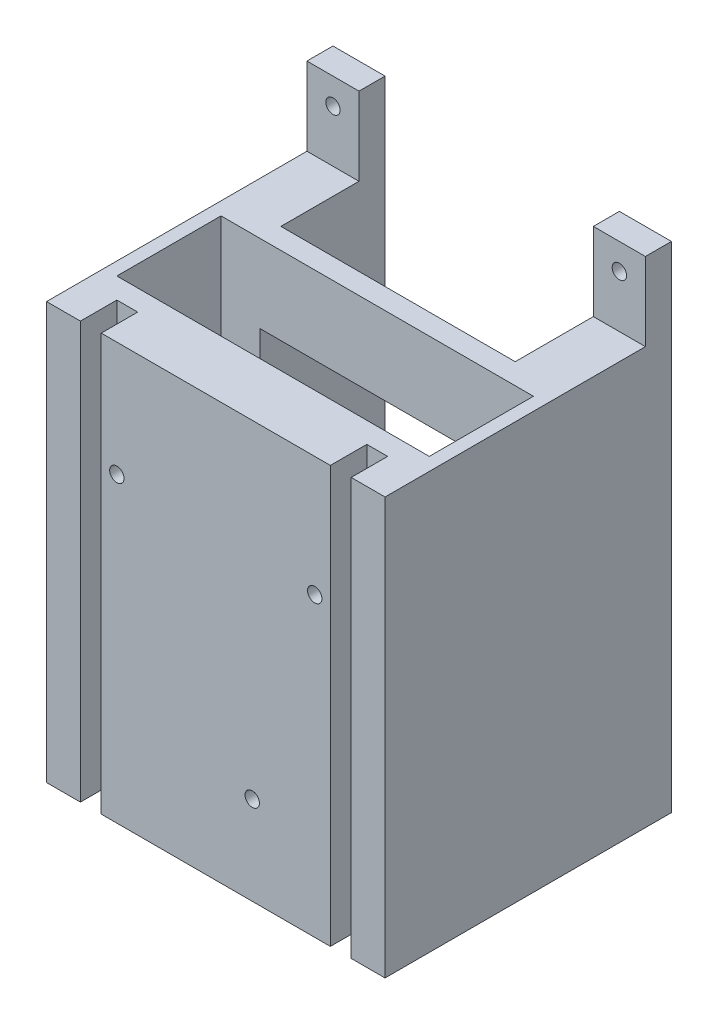
ISO-10303-21;
HEADER;
FILE_DESCRIPTION(('STEP AP214'),'2;1');
FILE_NAME('part.step','',(''),(''),'','','');
FILE_SCHEMA(('AUTOMOTIVE_DESIGN { 1 0 10303 214 1 1 1 1 }'));
ENDSEC;
DATA;
#1=APPLICATION_CONTEXT('core data for automotive mechanical design processes');
#2=APPLICATION_PROTOCOL_DEFINITION('international standard','automotive_design',2000,#1);
#3=PRODUCT_CONTEXT('',#1,'mechanical');
#4=PRODUCT('Part','Part','',(#3));
#5=PRODUCT_RELATED_PRODUCT_CATEGORY('part','',(#4));
#6=PRODUCT_DEFINITION_FORMATION('','',#4);
#7=PRODUCT_DEFINITION_CONTEXT('part definition',#1,'design');
#8=PRODUCT_DEFINITION('design','',#6,#7);
#9=PRODUCT_DEFINITION_SHAPE('','',#8);
#10=(LENGTH_UNIT() NAMED_UNIT(*) SI_UNIT(.MILLI.,.METRE.));
#11=(NAMED_UNIT(*) PLANE_ANGLE_UNIT() SI_UNIT($,.RADIAN.));
#12=(NAMED_UNIT(*) SI_UNIT($,.STERADIAN.) SOLID_ANGLE_UNIT());
#13=UNCERTAINTY_MEASURE_WITH_UNIT(LENGTH_MEASURE(1.E-05),#10,'distance_accuracy_value','');
#14=(GEOMETRIC_REPRESENTATION_CONTEXT(3) GLOBAL_UNCERTAINTY_ASSIGNED_CONTEXT((#13)) GLOBAL_UNIT_ASSIGNED_CONTEXT((#10,
#11,#12)) REPRESENTATION_CONTEXT('',''));
#15=CARTESIAN_POINT('',(0.,0.,0.));
#16=DIRECTION('',(0.,0.,1.));
#17=DIRECTION('',(1.,0.,0.));
#18=AXIS2_PLACEMENT_3D('',#15,#16,#17);
#19=CARTESIAN_POINT('',(-41.275,139.7,69.85));
#20=DIRECTION('',(0.,-1.,0.));
#21=DIRECTION('',(0.,0.,-1.));
#22=AXIS2_PLACEMENT_3D('',#19,#20,#21);
#23=PLANE('',#22);
#24=DIRECTION('',(-1.,0.,0.));
#25=VECTOR('',#24,1.);
#26=CARTESIAN_POINT('',(41.275,139.7,6.35));
#27=LINE('',#26,#25);
#28=CARTESIAN_POINT('',(-28.575,139.7,6.35));
#29=VERTEX_POINT('',#28);
#30=CARTESIAN_POINT('',(-41.275,139.7,6.35));
#31=VERTEX_POINT('',#30);
#32=EDGE_CURVE('E336',#29,#31,#27,.T.);
#33=ORIENTED_EDGE('',*,*,#32,.F.);
#34=DIRECTION('',(0.,0.,1.));
#35=VECTOR('',#34,1.);
#36=CARTESIAN_POINT('',(-28.575,139.7,25.4));
#37=LINE('',#36,#35);
#38=CARTESIAN_POINT('',(-28.575,139.7,0.));
#39=VERTEX_POINT('',#38);
#40=EDGE_CURVE('E466',#39,#29,#37,.T.);
#41=ORIENTED_EDGE('',*,*,#40,.F.);
#42=DIRECTION('',(-1.,0.,0.));
#43=VECTOR('',#42,1.);
#44=CARTESIAN_POINT('',(-41.275,139.7,0.));
#45=LINE('',#44,#43);
#46=CARTESIAN_POINT('',(-41.275,139.7,0.));
#47=VERTEX_POINT('',#46);
#48=EDGE_CURVE('E274',#39,#47,#45,.T.);
#49=ORIENTED_EDGE('',*,*,#48,.T.);
#50=DIRECTION('',(0.,0.,-1.));
#51=VECTOR('',#50,1.);
#52=CARTESIAN_POINT('',(-41.275,139.7,69.85));
#53=LINE('',#52,#51);
#54=EDGE_CURVE('E263',#31,#47,#53,.T.);
#55=ORIENTED_EDGE('',*,*,#54,.F.);
#56=EDGE_LOOP('',(#33,#41,#49,#55));
#57=FACE_BOUND('',#56,.T.);
#58=ADVANCED_FACE('F52',(#57),#23,.F.);
#59=CARTESIAN_POINT('',(0.,0.,0.));
#60=DIRECTION('',(0.,0.,1.));
#61=DIRECTION('',(1.,0.,0.));
#62=AXIS2_PLACEMENT_3D('',#59,#60,#61);
#63=PLANE('',#62);
#64=CARTESIAN_POINT('',(-34.925,133.35,0.));
#65=DIRECTION('',(0.,0.,1.));
#66=DIRECTION('',(1.,0.,0.));
#67=AXIS2_PLACEMENT_3D('',#64,#65,#66);
#68=CIRCLE('',#67,1.75259999999999);
#69=CARTESIAN_POINT('',(-33.1724,133.35,0.));
#70=VERTEX_POINT('',#69);
#71=EDGE_CURVE('E739',#70,#70,#68,.F.);
#72=ORIENTED_EDGE('',*,*,#71,.F.);
#73=EDGE_LOOP('',(#72));
#74=FACE_BOUND('',#73,.T.);
#75=DIRECTION('',(0.,1.,0.));
#76=VECTOR('',#75,1.);
#77=CARTESIAN_POINT('',(-28.575,19.05,0.));
#78=LINE('',#77,#76);
#79=CARTESIAN_POINT('',(-28.575,19.05,0.));
#80=VERTEX_POINT('',#79);
#81=EDGE_CURVE('E255',#80,#39,#78,.T.);
#82=ORIENTED_EDGE('',*,*,#81,.F.);
#83=DIRECTION('',(1.,0.,0.));
#84=VECTOR('',#83,1.);
#85=CARTESIAN_POINT('',(-41.275,19.05,0.));
#86=LINE('',#85,#84);
#87=CARTESIAN_POINT('',(-41.275,19.05,0.));
#88=VERTEX_POINT('',#87);
#89=EDGE_CURVE('E238',#88,#80,#86,.T.);
#90=ORIENTED_EDGE('',*,*,#89,.F.);
#91=DIRECTION('',(0.,-1.,0.));
#92=VECTOR('',#91,1.);
#93=CARTESIAN_POINT('',(-41.275,139.7,0.));
#94=LINE('',#93,#92);
#95=EDGE_CURVE('E254',#47,#88,#94,.T.);
#96=ORIENTED_EDGE('',*,*,#95,.F.);
#97=ORIENTED_EDGE('',*,*,#48,.F.);
#98=EDGE_LOOP('',(#82,#90,#96,#97));
#99=FACE_BOUND('',#98,.T.);
#100=ADVANCED_FACE('F252',(#74,#99),#63,.F.);
#101=CARTESIAN_POINT('',(41.275,139.7,6.35));
#102=DIRECTION('',(0.,0.,-1.));
#103=DIRECTION('',(0.,1.,0.));
#104=AXIS2_PLACEMENT_3D('',#101,#102,#103);
#105=PLANE('',#104);
#106=CARTESIAN_POINT('',(-34.925,133.35,6.35000000000001));
#107=DIRECTION('',(0.,0.,1.));
#108=DIRECTION('',(1.,0.,0.));
#109=AXIS2_PLACEMENT_3D('',#106,#107,#108);
#110=CIRCLE('',#109,1.75259999999999);
#111=CARTESIAN_POINT('',(-33.1724,133.35,6.35000000000001));
#112=VERTEX_POINT('',#111);
#113=EDGE_CURVE('E743',#112,#112,#110,.T.);
#114=ORIENTED_EDGE('',*,*,#113,.F.);
#115=EDGE_LOOP('',(#114));
#116=FACE_BOUND('',#115,.T.);
#117=DIRECTION('',(-1.,0.,0.));
#118=VECTOR('',#117,1.);
#119=CARTESIAN_POINT('',(41.275,120.65,6.35));
#120=LINE('',#119,#118);
#121=CARTESIAN_POINT('',(-28.575,120.65,6.35));
#122=VERTEX_POINT('',#121);
#123=CARTESIAN_POINT('',(-41.275,120.65,6.35));
#124=VERTEX_POINT('',#123);
#125=EDGE_CURVE('E350',#122,#124,#120,.T.);
#126=ORIENTED_EDGE('',*,*,#125,.F.);
#127=DIRECTION('',(0.,1.,0.));
#128=VECTOR('',#127,1.);
#129=CARTESIAN_POINT('',(-28.575,139.7,6.35));
#130=LINE('',#129,#128);
#131=EDGE_CURVE('E288',#122,#29,#130,.T.);
#132=ORIENTED_EDGE('',*,*,#131,.T.);
#133=ORIENTED_EDGE('',*,*,#32,.T.);
#134=DIRECTION('',(0.,-1.,0.));
#135=VECTOR('',#134,1.);
#136=CARTESIAN_POINT('',(-41.275,139.7,6.35));
#137=LINE('',#136,#135);
#138=EDGE_CURVE('E319',#31,#124,#137,.T.);
#139=ORIENTED_EDGE('',*,*,#138,.T.);
#140=EDGE_LOOP('',(#126,#132,#133,#139));
#141=FACE_BOUND('',#140,.T.);
#142=ADVANCED_FACE('F570',(#116,#141),#105,.F.);
#143=CARTESIAN_POINT('',(0.,0.,69.85));
#144=DIRECTION('',(0.,0.,1.));
#145=DIRECTION('',(1.,0.,0.));
#146=AXIS2_PLACEMENT_3D('',#143,#144,#145);
#147=PLANE('',#146);
#148=DIRECTION('',(1.,0.,0.));
#149=VECTOR('',#148,1.);
#150=CARTESIAN_POINT('',(-41.275,19.05,69.85));
#151=LINE('',#150,#149);
#152=CARTESIAN_POINT('',(-41.275,19.05,69.85));
#153=VERTEX_POINT('',#152);
#154=CARTESIAN_POINT('',(-33.02,19.05,69.85));
#155=VERTEX_POINT('',#154);
#156=EDGE_CURVE('E240',#153,#155,#151,.T.);
#157=ORIENTED_EDGE('',*,*,#156,.T.);
#158=DIRECTION('',(0.,1.,0.));
#159=VECTOR('',#158,1.);
#160=CARTESIAN_POINT('',(-33.02,19.05,69.85));
#161=LINE('',#160,#159);
#162=CARTESIAN_POINT('',(-33.02,120.65,69.85));
#163=VERTEX_POINT('',#162);
#164=EDGE_CURVE('E376',#155,#163,#161,.T.);
#165=ORIENTED_EDGE('',*,*,#164,.T.);
#166=DIRECTION('',(-1.,0.,0.));
#167=VECTOR('',#166,1.);
#168=CARTESIAN_POINT('',(41.275,120.65,69.85));
#169=LINE('',#168,#167);
#170=CARTESIAN_POINT('',(-41.275,120.65,69.85));
#171=VERTEX_POINT('',#170);
#172=EDGE_CURVE('E346',#163,#171,#169,.T.);
#173=ORIENTED_EDGE('',*,*,#172,.T.);
#174=DIRECTION('',(0.,-1.,0.));
#175=VECTOR('',#174,1.);
#176=CARTESIAN_POINT('',(-41.275,139.7,69.85));
#177=LINE('',#176,#175);
#178=EDGE_CURVE('E271',#171,#153,#177,.T.);
#179=ORIENTED_EDGE('',*,*,#178,.T.);
#180=EDGE_LOOP('',(#157,#165,#173,#179));
#181=FACE_BOUND('',#180,.T.);
#182=ADVANCED_FACE('F562',(#181),#147,.T.);
#183=CARTESIAN_POINT('',(-27.94,19.05,69.85));
#184=VERTEX_POINT('',#183);
#185=CARTESIAN_POINT('',(27.94,19.05,69.85));
#186=VERTEX_POINT('',#185);
#187=EDGE_CURVE('E605',#184,#186,#151,.T.);
#188=ORIENTED_EDGE('',*,*,#187,.T.);
#189=DIRECTION('',(0.,-1.,0.));
#190=VECTOR('',#189,1.);
#191=CARTESIAN_POINT('',(27.94,120.65,69.85));
#192=LINE('',#191,#190);
#193=CARTESIAN_POINT('',(27.94,120.65,69.85));
#194=VERTEX_POINT('',#193);
#195=EDGE_CURVE('E399',#194,#186,#192,.T.);
#196=ORIENTED_EDGE('',*,*,#195,.F.);
#197=CARTESIAN_POINT('',(-27.94,120.65,69.85));
#198=VERTEX_POINT('',#197);
#199=EDGE_CURVE('E345',#194,#198,#169,.T.);
#200=ORIENTED_EDGE('',*,*,#199,.T.);
#201=DIRECTION('',(0.,-1.,0.));
#202=VECTOR('',#201,1.);
#203=CARTESIAN_POINT('',(-27.94,120.65,69.85));
#204=LINE('',#203,#202);
#205=EDGE_CURVE('E370',#198,#184,#204,.T.);
#206=ORIENTED_EDGE('',*,*,#205,.T.);
#207=EDGE_LOOP('',(#188,#196,#200,#206));
#208=FACE_BOUND('',#207,.T.);
#209=CARTESIAN_POINT('',(-24.1300023448818,92.7200021786394,69.85));
#210=DIRECTION('',(0.,0.,1.));
#211=DIRECTION('',(1.,0.,0.));
#212=AXIS2_PLACEMENT_3D('',#209,#210,#211);
#213=CIRCLE('',#212,1.7526);
#214=CARTESIAN_POINT('',(-22.3774023448818,92.7200021786394,69.85));
#215=VERTEX_POINT('',#214);
#216=EDGE_CURVE('E537',#215,#215,#213,.T.);
#217=ORIENTED_EDGE('',*,*,#216,.F.);
#218=EDGE_LOOP('',(#217));
#219=FACE_BOUND('',#218,.T.);
#220=CARTESIAN_POINT('',(24.1299976062424,91.4500003213605,69.85));
#221=DIRECTION('',(0.,0.,1.));
#222=DIRECTION('',(1.,0.,0.));
#223=AXIS2_PLACEMENT_3D('',#220,#221,#222);
#224=CIRCLE('',#223,1.7526);
#225=CARTESIAN_POINT('',(25.8825976062424,91.4500003213605,69.85));
#226=VERTEX_POINT('',#225);
#227=EDGE_CURVE('E545',#226,#226,#224,.T.);
#228=ORIENTED_EDGE('',*,*,#227,.F.);
#229=EDGE_LOOP('',(#228));
#230=FACE_BOUND('',#229,.T.);
#231=CARTESIAN_POINT('',(8.88999565121206,40.6500009078697,69.85));
#232=DIRECTION('',(0.,0.,1.));
#233=DIRECTION('',(1.,0.,0.));
#234=AXIS2_PLACEMENT_3D('',#231,#232,#233);
#235=CIRCLE('',#234,1.7526);
#236=CARTESIAN_POINT('',(10.6425956512121,40.6500009078697,69.85));
#237=VERTEX_POINT('',#236);
#238=EDGE_CURVE('E476',#237,#237,#235,.T.);
#239=ORIENTED_EDGE('',*,*,#238,.F.);
#240=EDGE_LOOP('',(#239));
#241=FACE_BOUND('',#240,.T.);
#242=ADVANCED_FACE('F559',(#208,#219,#230,#241),#147,.T.);
#243=CARTESIAN_POINT('',(33.02,19.05,69.85));
#244=VERTEX_POINT('',#243);
#245=CARTESIAN_POINT('',(41.275,19.05,69.85));
#246=VERTEX_POINT('',#245);
#247=EDGE_CURVE('E257',#244,#246,#151,.T.);
#248=ORIENTED_EDGE('',*,*,#247,.T.);
#249=DIRECTION('',(0.,1.,0.));
#250=VECTOR('',#249,1.);
#251=CARTESIAN_POINT('',(41.275,139.7,69.85));
#252=LINE('',#251,#250);
#253=CARTESIAN_POINT('',(41.275,120.65,69.85));
#254=VERTEX_POINT('',#253);
#255=EDGE_CURVE('E265',#246,#254,#252,.T.);
#256=ORIENTED_EDGE('',*,*,#255,.T.);
#257=CARTESIAN_POINT('',(33.02,120.65,69.85));
#258=VERTEX_POINT('',#257);
#259=EDGE_CURVE('E340',#254,#258,#169,.T.);
#260=ORIENTED_EDGE('',*,*,#259,.T.);
#261=DIRECTION('',(0.,1.,0.));
#262=VECTOR('',#261,1.);
#263=CARTESIAN_POINT('',(33.02,19.05,69.85));
#264=LINE('',#263,#262);
#265=EDGE_CURVE('E392',#244,#258,#264,.T.);
#266=ORIENTED_EDGE('',*,*,#265,.F.);
#267=EDGE_LOOP('',(#248,#256,#260,#266));
#268=FACE_BOUND('',#267,.T.);
#269=ADVANCED_FACE('F561',(#268),#147,.T.);
#270=CARTESIAN_POINT('',(41.275,139.7,69.85));
#271=DIRECTION('',(-1.,0.,0.));
#272=DIRECTION('',(0.,0.,1.));
#273=AXIS2_PLACEMENT_3D('',#270,#271,#272);
#274=PLANE('',#273);
#275=ORIENTED_EDGE('',*,*,#255,.F.);
#276=DIRECTION('',(0.,0.,1.));
#277=VECTOR('',#276,1.);
#278=CARTESIAN_POINT('',(41.275,19.05,0.));
#279=LINE('',#278,#277);
#280=CARTESIAN_POINT('',(41.275,19.05,0.));
#281=VERTEX_POINT('',#280);
#282=EDGE_CURVE('E247',#281,#246,#279,.T.);
#283=ORIENTED_EDGE('',*,*,#282,.F.);
#284=DIRECTION('',(0.,1.,0.));
#285=VECTOR('',#284,1.);
#286=CARTESIAN_POINT('',(41.275,139.7,0.));
#287=LINE('',#286,#285);
#288=CARTESIAN_POINT('',(41.275,139.7,0.));
#289=VERTEX_POINT('',#288);
#290=EDGE_CURVE('E442',#281,#289,#287,.T.);
#291=ORIENTED_EDGE('',*,*,#290,.T.);
#292=DIRECTION('',(0.,0.,-1.));
#293=VECTOR('',#292,1.);
#294=CARTESIAN_POINT('',(41.275,139.7,69.85));
#295=LINE('',#294,#293);
#296=CARTESIAN_POINT('',(41.275,139.7,6.35));
#297=VERTEX_POINT('',#296);
#298=EDGE_CURVE('E280',#297,#289,#295,.T.);
#299=ORIENTED_EDGE('',*,*,#298,.F.);
#300=DIRECTION('',(0.,-1.,0.));
#301=VECTOR('',#300,1.);
#302=CARTESIAN_POINT('',(41.275,139.7,6.35));
#303=LINE('',#302,#301);
#304=CARTESIAN_POINT('',(41.275,120.65,6.35));
#305=VERTEX_POINT('',#304);
#306=EDGE_CURVE('E329',#297,#305,#303,.T.);
#307=ORIENTED_EDGE('',*,*,#306,.T.);
#308=DIRECTION('',(0.,0.,1.));
#309=VECTOR('',#308,1.);
#310=CARTESIAN_POINT('',(41.275,120.65,6.35));
#311=LINE('',#310,#309);
#312=EDGE_CURVE('E333',#305,#254,#311,.T.);
#313=ORIENTED_EDGE('',*,*,#312,.T.);
#314=EDGE_LOOP('',(#275,#283,#291,#299,#307,#313));
#315=FACE_BOUND('',#314,.T.);
#316=ADVANCED_FACE('F54',(#315),#274,.F.);
#317=CARTESIAN_POINT('',(28.575,139.7,0.));
#318=VERTEX_POINT('',#317);
#319=EDGE_CURVE('E266',#289,#318,#45,.T.);
#320=ORIENTED_EDGE('',*,*,#319,.T.);
#321=DIRECTION('',(0.,0.,-1.));
#322=VECTOR('',#321,1.);
#323=CARTESIAN_POINT('',(28.575,139.7,0.));
#324=LINE('',#323,#322);
#325=CARTESIAN_POINT('',(28.575,139.7,6.35));
#326=VERTEX_POINT('',#325);
#327=EDGE_CURVE('E314',#326,#318,#324,.T.);
#328=ORIENTED_EDGE('',*,*,#327,.F.);
#329=EDGE_CURVE('E351',#297,#326,#27,.T.);
#330=ORIENTED_EDGE('',*,*,#329,.F.);
#331=ORIENTED_EDGE('',*,*,#298,.T.);
#332=EDGE_LOOP('',(#320,#328,#330,#331));
#333=FACE_BOUND('',#332,.T.);
#334=ADVANCED_FACE('F577',(#333),#23,.F.);
#335=CARTESIAN_POINT('',(-41.275,139.7,69.85));
#336=DIRECTION('',(1.,0.,0.));
#337=DIRECTION('',(0.,1.,0.));
#338=AXIS2_PLACEMENT_3D('',#335,#336,#337);
#339=PLANE('',#338);
#340=ORIENTED_EDGE('',*,*,#95,.T.);
#341=DIRECTION('',(0.,0.,1.));
#342=VECTOR('',#341,1.);
#343=CARTESIAN_POINT('',(-41.275,19.05,0.));
#344=LINE('',#343,#342);
#345=EDGE_CURVE('E235',#88,#153,#344,.T.);
#346=ORIENTED_EDGE('',*,*,#345,.T.);
#347=ORIENTED_EDGE('',*,*,#178,.F.);
#348=DIRECTION('',(0.,0.,1.));
#349=VECTOR('',#348,1.);
#350=CARTESIAN_POINT('',(-41.275,120.65,6.35));
#351=LINE('',#350,#349);
#352=EDGE_CURVE('E325',#124,#171,#351,.T.);
#353=ORIENTED_EDGE('',*,*,#352,.F.);
#354=ORIENTED_EDGE('',*,*,#138,.F.);
#355=ORIENTED_EDGE('',*,*,#54,.T.);
#356=EDGE_LOOP('',(#340,#346,#347,#353,#354,#355));
#357=FACE_BOUND('',#356,.T.);
#358=ADVANCED_FACE('F260',(#357),#339,.F.);
#359=CARTESIAN_POINT('',(34.925,133.35,0.));
#360=DIRECTION('',(0.,0.,1.));
#361=DIRECTION('',(1.,0.,0.));
#362=AXIS2_PLACEMENT_3D('',#359,#360,#361);
#363=CIRCLE('',#362,1.75259999999999);
#364=CARTESIAN_POINT('',(36.6776,133.35,0.));
#365=VERTEX_POINT('',#364);
#366=EDGE_CURVE('E753',#365,#365,#363,.T.);
#367=ORIENTED_EDGE('',*,*,#366,.T.);
#368=EDGE_LOOP('',(#367));
#369=FACE_BOUND('',#368,.T.);
#370=ORIENTED_EDGE('',*,*,#290,.F.);
#371=CARTESIAN_POINT('',(28.575,19.05,0.));
#372=VERTEX_POINT('',#371);
#373=EDGE_CURVE('E246',#372,#281,#86,.T.);
#374=ORIENTED_EDGE('',*,*,#373,.F.);
#375=DIRECTION('',(0.,1.,0.));
#376=VECTOR('',#375,1.);
#377=CARTESIAN_POINT('',(28.575,19.05,0.));
#378=LINE('',#377,#376);
#379=EDGE_CURVE('E482',#372,#318,#378,.T.);
#380=ORIENTED_EDGE('',*,*,#379,.T.);
#381=ORIENTED_EDGE('',*,*,#319,.F.);
#382=EDGE_LOOP('',(#370,#374,#380,#381));
#383=FACE_BOUND('',#382,.T.);
#384=ADVANCED_FACE('F582',(#369,#383),#63,.F.);
#385=CARTESIAN_POINT('',(27.94,120.65,60.96));
#386=DIRECTION('',(-1.,0.,0.));
#387=DIRECTION('',(0.,-1.,0.));
#388=AXIS2_PLACEMENT_3D('',#385,#386,#387);
#389=PLANE('',#388);
#390=ORIENTED_EDGE('',*,*,#195,.T.);
#391=DIRECTION('',(0.,0.,-1.));
#392=VECTOR('',#391,1.);
#393=CARTESIAN_POINT('',(27.94,19.05,60.96));
#394=LINE('',#393,#392);
#395=CARTESIAN_POINT('',(27.94,19.05,60.96));
#396=VERTEX_POINT('',#395);
#397=EDGE_CURVE('E502',#186,#396,#394,.T.);
#398=ORIENTED_EDGE('',*,*,#397,.T.);
#399=DIRECTION('',(0.,-1.,0.));
#400=VECTOR('',#399,1.);
#401=CARTESIAN_POINT('',(27.94,120.65,60.96));
#402=LINE('',#401,#400);
#403=CARTESIAN_POINT('',(27.94,120.65,60.96));
#404=VERTEX_POINT('',#403);
#405=EDGE_CURVE('E403',#404,#396,#402,.T.);
#406=ORIENTED_EDGE('',*,*,#405,.F.);
#407=DIRECTION('',(0.,0.,1.));
#408=VECTOR('',#407,1.);
#409=CARTESIAN_POINT('',(27.94,120.65,60.96));
#410=LINE('',#409,#408);
#411=EDGE_CURVE('E413',#404,#194,#410,.T.);
#412=ORIENTED_EDGE('',*,*,#411,.T.);
#413=EDGE_LOOP('',(#390,#398,#406,#412));
#414=FACE_BOUND('',#413,.T.);
#415=ADVANCED_FACE('F645',(#414),#389,.F.);
#416=CARTESIAN_POINT('',(33.02,19.05,60.96));
#417=DIRECTION('',(1.,0.,0.));
#418=DIRECTION('',(0.,0.,-1.));
#419=AXIS2_PLACEMENT_3D('',#416,#417,#418);
#420=PLANE('',#419);
#421=DIRECTION('',(0.,1.,0.));
#422=VECTOR('',#421,1.);
#423=CARTESIAN_POINT('',(33.02,19.05,60.96));
#424=LINE('',#423,#422);
#425=CARTESIAN_POINT('',(33.02,19.05,60.96));
#426=VERTEX_POINT('',#425);
#427=CARTESIAN_POINT('',(33.02,120.65,60.96));
#428=VERTEX_POINT('',#427);
#429=EDGE_CURVE('E395',#426,#428,#424,.T.);
#430=ORIENTED_EDGE('',*,*,#429,.F.);
#431=DIRECTION('',(0.,0.,1.));
#432=VECTOR('',#431,1.);
#433=CARTESIAN_POINT('',(33.02,19.05,60.96));
#434=LINE('',#433,#432);
#435=EDGE_CURVE('E511',#426,#244,#434,.T.);
#436=ORIENTED_EDGE('',*,*,#435,.T.);
#437=ORIENTED_EDGE('',*,*,#265,.T.);
#438=DIRECTION('',(0.,0.,1.));
#439=VECTOR('',#438,1.);
#440=CARTESIAN_POINT('',(33.02,120.65,60.96));
#441=LINE('',#440,#439);
#442=EDGE_CURVE('E407',#428,#258,#441,.T.);
#443=ORIENTED_EDGE('',*,*,#442,.F.);
#444=EDGE_LOOP('',(#430,#436,#437,#443));
#445=FACE_BOUND('',#444,.T.);
#446=ADVANCED_FACE('F637',(#445),#420,.F.);
#447=CARTESIAN_POINT('',(0.,0.,60.96));
#448=DIRECTION('',(0.,0.,1.));
#449=DIRECTION('',(1.,0.,0.));
#450=AXIS2_PLACEMENT_3D('',#447,#448,#449);
#451=PLANE('',#450);
#452=DIRECTION('',(-1.,0.,0.));
#453=VECTOR('',#452,1.);
#454=CARTESIAN_POINT('',(0.,19.05,60.96));
#455=LINE('',#454,#453);
#456=EDGE_CURVE('E630',#426,#396,#455,.T.);
#457=ORIENTED_EDGE('',*,*,#456,.F.);
#458=ORIENTED_EDGE('',*,*,#429,.T.);
#459=DIRECTION('',(-1.,0.,0.));
#460=VECTOR('',#459,1.);
#461=CARTESIAN_POINT('',(33.02,120.65,60.96));
#462=LINE('',#461,#460);
#463=EDGE_CURVE('E398',#428,#404,#462,.T.);
#464=ORIENTED_EDGE('',*,*,#463,.T.);
#465=ORIENTED_EDGE('',*,*,#405,.T.);
#466=EDGE_LOOP('',(#457,#458,#464,#465));
#467=FACE_BOUND('',#466,.T.);
#468=ADVANCED_FACE('F641',(#467),#451,.T.);
#469=CARTESIAN_POINT('',(-33.02,19.05,60.96));
#470=DIRECTION('',(1.,0.,0.));
#471=DIRECTION('',(0.,0.,-1.));
#472=AXIS2_PLACEMENT_3D('',#469,#470,#471);
#473=PLANE('',#472);
#474=DIRECTION('',(0.,0.,1.));
#475=VECTOR('',#474,1.);
#476=CARTESIAN_POINT('',(-33.02,19.05,60.96));
#477=LINE('',#476,#475);
#478=CARTESIAN_POINT('',(-33.02,19.05,60.96));
#479=VERTEX_POINT('',#478);
#480=EDGE_CURVE('E627',#479,#155,#477,.T.);
#481=ORIENTED_EDGE('',*,*,#480,.F.);
#482=DIRECTION('',(0.,1.,0.));
#483=VECTOR('',#482,1.);
#484=CARTESIAN_POINT('',(-33.02,19.05,60.96));
#485=LINE('',#484,#483);
#486=CARTESIAN_POINT('',(-33.02,120.65,60.96));
#487=VERTEX_POINT('',#486);
#488=EDGE_CURVE('E379',#479,#487,#485,.T.);
#489=ORIENTED_EDGE('',*,*,#488,.T.);
#490=DIRECTION('',(0.,0.,1.));
#491=VECTOR('',#490,1.);
#492=CARTESIAN_POINT('',(-33.02,120.65,60.96));
#493=LINE('',#492,#491);
#494=EDGE_CURVE('E388',#487,#163,#493,.T.);
#495=ORIENTED_EDGE('',*,*,#494,.T.);
#496=ORIENTED_EDGE('',*,*,#164,.F.);
#497=EDGE_LOOP('',(#481,#489,#495,#496));
#498=FACE_BOUND('',#497,.T.);
#499=ADVANCED_FACE('F662',(#498),#473,.T.);
#500=CARTESIAN_POINT('',(-27.94,120.65,60.96));
#501=DIRECTION('',(-1.,0.,0.));
#502=DIRECTION('',(0.,-1.,0.));
#503=AXIS2_PLACEMENT_3D('',#500,#501,#502);
#504=PLANE('',#503);
#505=DIRECTION('',(0.,0.,-1.));
#506=VECTOR('',#505,1.);
#507=CARTESIAN_POINT('',(-27.94,19.05,60.96));
#508=LINE('',#507,#506);
#509=CARTESIAN_POINT('',(-27.94,19.05,60.96));
#510=VERTEX_POINT('',#509);
#511=EDGE_CURVE('E624',#184,#510,#508,.T.);
#512=ORIENTED_EDGE('',*,*,#511,.F.);
#513=ORIENTED_EDGE('',*,*,#205,.F.);
#514=DIRECTION('',(0.,0.,1.));
#515=VECTOR('',#514,1.);
#516=CARTESIAN_POINT('',(-27.94,120.65,60.96));
#517=LINE('',#516,#515);
#518=CARTESIAN_POINT('',(-27.94,120.65,60.96));
#519=VERTEX_POINT('',#518);
#520=EDGE_CURVE('E382',#519,#198,#517,.T.);
#521=ORIENTED_EDGE('',*,*,#520,.F.);
#522=DIRECTION('',(0.,-1.,0.));
#523=VECTOR('',#522,1.);
#524=CARTESIAN_POINT('',(-27.94,120.65,60.96));
#525=LINE('',#524,#523);
#526=EDGE_CURVE('E371',#519,#510,#525,.T.);
#527=ORIENTED_EDGE('',*,*,#526,.T.);
#528=EDGE_LOOP('',(#512,#513,#521,#527));
#529=FACE_BOUND('',#528,.T.);
#530=ADVANCED_FACE('F652',(#529),#504,.T.);
#531=CARTESIAN_POINT('',(0.,0.,60.96));
#532=DIRECTION('',(0.,0.,1.));
#533=DIRECTION('',(-1.,0.,0.));
#534=AXIS2_PLACEMENT_3D('',#531,#532,#533);
#535=PLANE('',#534);
#536=DIRECTION('',(-1.,0.,0.));
#537=VECTOR('',#536,1.);
#538=CARTESIAN_POINT('',(0.,19.05,60.96));
#539=LINE('',#538,#537);
#540=EDGE_CURVE('E619',#510,#479,#539,.T.);
#541=ORIENTED_EDGE('',*,*,#540,.F.);
#542=ORIENTED_EDGE('',*,*,#526,.F.);
#543=DIRECTION('',(1.,0.,0.));
#544=VECTOR('',#543,1.);
#545=CARTESIAN_POINT('',(-33.02,120.65,60.96));
#546=LINE('',#545,#544);
#547=EDGE_CURVE('E375',#487,#519,#546,.T.);
#548=ORIENTED_EDGE('',*,*,#547,.F.);
#549=ORIENTED_EDGE('',*,*,#488,.F.);
#550=EDGE_LOOP('',(#541,#542,#548,#549));
#551=FACE_BOUND('',#550,.T.);
#552=ADVANCED_FACE('F658',(#551),#535,.T.);
#553=CARTESIAN_POINT('',(41.275,120.65,6.35));
#554=DIRECTION('',(0.,-1.,0.));
#555=DIRECTION('',(1.,0.,0.));
#556=AXIS2_PLACEMENT_3D('',#553,#554,#555);
#557=PLANE('',#556);
#558=DIRECTION('',(-1.,0.,0.));
#559=VECTOR('',#558,1.);
#560=CARTESIAN_POINT('',(41.275,120.65,25.4));
#561=LINE('',#560,#559);
#562=CARTESIAN_POINT('',(28.575,120.65,25.4));
#563=VERTEX_POINT('',#562);
#564=CARTESIAN_POINT('',(-28.575,120.65,25.4));
#565=VERTEX_POINT('',#564);
#566=EDGE_CURVE('E61',#563,#565,#561,.T.);
#567=ORIENTED_EDGE('',*,*,#566,.T.);
#568=DIRECTION('',(0.,0.,-1.));
#569=VECTOR('',#568,1.);
#570=CARTESIAN_POINT('',(-28.575,120.65,6.35));
#571=LINE('',#570,#569);
#572=EDGE_CURVE('E301',#565,#122,#571,.T.);
#573=ORIENTED_EDGE('',*,*,#572,.T.);
#574=ORIENTED_EDGE('',*,*,#125,.T.);
#575=ORIENTED_EDGE('',*,*,#352,.T.);
#576=ORIENTED_EDGE('',*,*,#172,.F.);
#577=ORIENTED_EDGE('',*,*,#494,.F.);
#578=ORIENTED_EDGE('',*,*,#547,.T.);
#579=ORIENTED_EDGE('',*,*,#520,.T.);
#580=ORIENTED_EDGE('',*,*,#199,.F.);
#581=ORIENTED_EDGE('',*,*,#411,.F.);
#582=ORIENTED_EDGE('',*,*,#463,.F.);
#583=ORIENTED_EDGE('',*,*,#442,.T.);
#584=ORIENTED_EDGE('',*,*,#259,.F.);
#585=ORIENTED_EDGE('',*,*,#312,.F.);
#586=CARTESIAN_POINT('',(28.575,120.65,6.35));
#587=VERTEX_POINT('',#586);
#588=EDGE_CURVE('E347',#305,#587,#120,.T.);
#589=ORIENTED_EDGE('',*,*,#588,.T.);
#590=DIRECTION('',(0.,0.,1.));
#591=VECTOR('',#590,1.);
#592=CARTESIAN_POINT('',(28.575,120.65,6.35));
#593=LINE('',#592,#591);
#594=EDGE_CURVE('E304',#587,#563,#593,.T.);
#595=ORIENTED_EDGE('',*,*,#594,.T.);
#596=EDGE_LOOP('',(#567,#573,#574,#575,#576,#577,#578,#579,#580,#581,#582,#583,#584,#585,#589,#595));
#597=FACE_BOUND('',#596,.T.);
#598=DIRECTION('',(-1.,0.,0.));
#599=VECTOR('',#598,1.);
#600=CARTESIAN_POINT('',(-38.1,120.65,30.48));
#601=LINE('',#600,#599);
#602=CARTESIAN_POINT('',(38.1,120.65,30.48));
#603=VERTEX_POINT('',#602);
#604=CARTESIAN_POINT('',(-38.1,120.65,30.48));
#605=VERTEX_POINT('',#604);
#606=EDGE_CURVE('E362',#603,#605,#601,.T.);
#607=ORIENTED_EDGE('',*,*,#606,.F.);
#608=DIRECTION('',(0.,0.,-1.));
#609=VECTOR('',#608,1.);
#610=CARTESIAN_POINT('',(38.1,120.65,30.48));
#611=LINE('',#610,#609);
#612=CARTESIAN_POINT('',(38.1,120.65,55.88));
#613=VERTEX_POINT('',#612);
#614=EDGE_CURVE('E358',#613,#603,#611,.T.);
#615=ORIENTED_EDGE('',*,*,#614,.F.);
#616=DIRECTION('',(1.,0.,0.));
#617=VECTOR('',#616,1.);
#618=CARTESIAN_POINT('',(38.1,120.65,55.88));
#619=LINE('',#618,#617);
#620=CARTESIAN_POINT('',(-38.1,120.65,55.88));
#621=VERTEX_POINT('',#620);
#622=EDGE_CURVE('E344',#621,#613,#619,.T.);
#623=ORIENTED_EDGE('',*,*,#622,.F.);
#624=DIRECTION('',(0.,0.,1.));
#625=VECTOR('',#624,1.);
#626=CARTESIAN_POINT('',(-38.1,120.65,55.88));
#627=LINE('',#626,#625);
#628=EDGE_CURVE('E366',#605,#621,#627,.T.);
#629=ORIENTED_EDGE('',*,*,#628,.F.);
#630=EDGE_LOOP('',(#607,#615,#623,#629));
#631=FACE_BOUND('',#630,.T.);
#632=ADVANCED_FACE('F298',(#597,#631),#557,.F.);
#633=CARTESIAN_POINT('',(34.925,133.35,6.35000000000001));
#634=DIRECTION('',(0.,0.,-1.));
#635=DIRECTION('',(-1.,0.,0.));
#636=AXIS2_PLACEMENT_3D('',#633,#634,#635);
#637=CIRCLE('',#636,1.75259999999999);
#638=CARTESIAN_POINT('',(33.1724,133.35,6.35000000000001));
#639=VERTEX_POINT('',#638);
#640=EDGE_CURVE('E748',#639,#639,#637,.T.);
#641=ORIENTED_EDGE('',*,*,#640,.T.);
#642=EDGE_LOOP('',(#641));
#643=FACE_BOUND('',#642,.T.);
#644=ORIENTED_EDGE('',*,*,#329,.T.);
#645=DIRECTION('',(0.,-1.,0.));
#646=VECTOR('',#645,1.);
#647=CARTESIAN_POINT('',(28.575,139.7,6.35));
#648=LINE('',#647,#646);
#649=EDGE_CURVE('E284',#326,#587,#648,.T.);
#650=ORIENTED_EDGE('',*,*,#649,.T.);
#651=ORIENTED_EDGE('',*,*,#588,.F.);
#652=ORIENTED_EDGE('',*,*,#306,.F.);
#653=EDGE_LOOP('',(#644,#650,#651,#652));
#654=FACE_BOUND('',#653,.T.);
#655=ADVANCED_FACE('F597',(#643,#654),#105,.F.);
#656=CARTESIAN_POINT('',(0.,31.75,0.));
#657=DIRECTION('',(0.,-1.,0.));
#658=DIRECTION('',(0.,0.,-1.));
#659=AXIS2_PLACEMENT_3D('',#656,#657,#658);
#660=PLANE('',#659);
#661=DIRECTION('',(-1.,0.,0.));
#662=VECTOR('',#661,1.);
#663=CARTESIAN_POINT('',(-38.1,31.75,30.48));
#664=LINE('',#663,#662);
#665=CARTESIAN_POINT('',(38.1,31.75,30.48));
#666=VERTEX_POINT('',#665);
#667=CARTESIAN_POINT('',(28.575,31.75,30.48));
#668=VERTEX_POINT('',#667);
#669=EDGE_CURVE('E433',#666,#668,#664,.T.);
#670=ORIENTED_EDGE('',*,*,#669,.T.);
#671=DIRECTION('',(0.,0.,1.));
#672=VECTOR('',#671,1.);
#673=CARTESIAN_POINT('',(28.575,31.75,0.));
#674=LINE('',#673,#672);
#675=CARTESIAN_POINT('',(28.575,31.75,38.1));
#676=VERTEX_POINT('',#675);
#677=EDGE_CURVE('E530',#668,#676,#674,.T.);
#678=ORIENTED_EDGE('',*,*,#677,.T.);
#679=DIRECTION('',(-1.,0.,0.));
#680=VECTOR('',#679,1.);
#681=CARTESIAN_POINT('',(0.,31.75,38.1));
#682=LINE('',#681,#680);
#683=CARTESIAN_POINT('',(-28.575,31.75,38.1));
#684=VERTEX_POINT('',#683);
#685=EDGE_CURVE('E497',#676,#684,#682,.T.);
#686=ORIENTED_EDGE('',*,*,#685,.T.);
#687=DIRECTION('',(0.,0.,-1.));
#688=VECTOR('',#687,1.);
#689=CARTESIAN_POINT('',(-28.575,31.75,0.));
#690=LINE('',#689,#688);
#691=CARTESIAN_POINT('',(-28.575,31.75,30.48));
#692=VERTEX_POINT('',#691);
#693=EDGE_CURVE('E524',#684,#692,#690,.T.);
#694=ORIENTED_EDGE('',*,*,#693,.T.);
#695=CARTESIAN_POINT('',(-38.1,31.75,30.48));
#696=VERTEX_POINT('',#695);
#697=EDGE_CURVE('E432',#692,#696,#664,.T.);
#698=ORIENTED_EDGE('',*,*,#697,.T.);
#699=DIRECTION('',(0.,0.,1.));
#700=VECTOR('',#699,1.);
#701=CARTESIAN_POINT('',(-38.1,31.75,55.88));
#702=LINE('',#701,#700);
#703=CARTESIAN_POINT('',(-38.1,31.75,55.88));
#704=VERTEX_POINT('',#703);
#705=EDGE_CURVE('E417',#696,#704,#702,.T.);
#706=ORIENTED_EDGE('',*,*,#705,.T.);
#707=DIRECTION('',(1.,0.,0.));
#708=VECTOR('',#707,1.);
#709=CARTESIAN_POINT('',(38.1,31.75,55.88));
#710=LINE('',#709,#708);
#711=CARTESIAN_POINT('',(38.1,31.75,55.88));
#712=VERTEX_POINT('',#711);
#713=EDGE_CURVE('E424',#704,#712,#710,.T.);
#714=ORIENTED_EDGE('',*,*,#713,.T.);
#715=DIRECTION('',(0.,0.,-1.));
#716=VECTOR('',#715,1.);
#717=CARTESIAN_POINT('',(38.1,31.75,30.48));
#718=LINE('',#717,#716);
#719=EDGE_CURVE('E428',#712,#666,#718,.T.);
#720=ORIENTED_EDGE('',*,*,#719,.T.);
#721=EDGE_LOOP('',(#670,#678,#686,#694,#698,#706,#714,#720));
#722=FACE_BOUND('',#721,.T.);
#723=ADVANCED_FACE('F702',(#722),#660,.F.);
#724=CARTESIAN_POINT('',(38.1,31.75,55.88));
#725=DIRECTION('',(0.,0.,1.));
#726=DIRECTION('',(1.,0.,0.));
#727=AXIS2_PLACEMENT_3D('',#724,#725,#726);
#728=PLANE('',#727);
#729=CARTESIAN_POINT('',(-24.1300023448818,92.7200021786394,55.88));
#730=DIRECTION('',(0.,0.,1.));
#731=DIRECTION('',(1.,0.,0.));
#732=AXIS2_PLACEMENT_3D('',#729,#730,#731);
#733=CIRCLE('',#732,1.7526);
#734=CARTESIAN_POINT('',(-22.3774023448818,92.7200021786394,55.88));
#735=VERTEX_POINT('',#734);
#736=EDGE_CURVE('E541',#735,#735,#733,.T.);
#737=ORIENTED_EDGE('',*,*,#736,.T.);
#738=EDGE_LOOP('',(#737));
#739=FACE_BOUND('',#738,.T.);
#740=CARTESIAN_POINT('',(24.1299976062424,91.4500003213605,55.88));
#741=DIRECTION('',(0.,0.,1.));
#742=DIRECTION('',(1.,0.,0.));
#743=AXIS2_PLACEMENT_3D('',#740,#741,#742);
#744=CIRCLE('',#743,1.7526);
#745=CARTESIAN_POINT('',(25.8825976062424,91.4500003213605,55.88));
#746=VERTEX_POINT('',#745);
#747=EDGE_CURVE('E549',#746,#746,#744,.T.);
#748=ORIENTED_EDGE('',*,*,#747,.T.);
#749=EDGE_LOOP('',(#748));
#750=FACE_BOUND('',#749,.T.);
#751=CARTESIAN_POINT('',(8.88999565121206,40.6500009078697,55.88));
#752=DIRECTION('',(0.,0.,1.));
#753=DIRECTION('',(1.,0.,0.));
#754=AXIS2_PLACEMENT_3D('',#751,#752,#753);
#755=CIRCLE('',#754,1.7526);
#756=CARTESIAN_POINT('',(10.6425956512121,40.6500009078697,55.88));
#757=VERTEX_POINT('',#756);
#758=EDGE_CURVE('E468',#757,#757,#755,.T.);
#759=ORIENTED_EDGE('',*,*,#758,.T.);
#760=EDGE_LOOP('',(#759));
#761=FACE_BOUND('',#760,.T.);
#762=DIRECTION('',(0.,1.,0.));
#763=VECTOR('',#762,1.);
#764=CARTESIAN_POINT('',(-38.1,31.75,55.88));
#765=LINE('',#764,#763);
#766=EDGE_CURVE('E437',#704,#621,#765,.T.);
#767=ORIENTED_EDGE('',*,*,#766,.T.);
#768=ORIENTED_EDGE('',*,*,#622,.T.);
#769=DIRECTION('',(0.,1.,0.));
#770=VECTOR('',#769,1.);
#771=CARTESIAN_POINT('',(38.1,31.75,55.88));
#772=LINE('',#771,#770);
#773=EDGE_CURVE('E447',#712,#613,#772,.T.);
#774=ORIENTED_EDGE('',*,*,#773,.F.);
#775=ORIENTED_EDGE('',*,*,#713,.F.);
#776=EDGE_LOOP('',(#767,#768,#774,#775));
#777=FACE_BOUND('',#776,.T.);
#778=ADVANCED_FACE('F711',(#739,#750,#761,#777),#728,.F.);
#779=CARTESIAN_POINT('',(38.1,31.75,30.48));
#780=DIRECTION('',(1.,0.,0.));
#781=DIRECTION('',(0.,0.,-1.));
#782=AXIS2_PLACEMENT_3D('',#779,#780,#781);
#783=PLANE('',#782);
#784=ORIENTED_EDGE('',*,*,#773,.T.);
#785=ORIENTED_EDGE('',*,*,#614,.T.);
#786=DIRECTION('',(0.,1.,0.));
#787=VECTOR('',#786,1.);
#788=CARTESIAN_POINT('',(38.1,31.75,30.48));
#789=LINE('',#788,#787);
#790=EDGE_CURVE('E443',#666,#603,#789,.T.);
#791=ORIENTED_EDGE('',*,*,#790,.F.);
#792=ORIENTED_EDGE('',*,*,#719,.F.);
#793=EDGE_LOOP('',(#784,#785,#791,#792));
#794=FACE_BOUND('',#793,.T.);
#795=ADVANCED_FACE('F817',(#794),#783,.F.);
#796=CARTESIAN_POINT('',(-38.1,31.75,30.48));
#797=DIRECTION('',(0.,0.,-1.));
#798=DIRECTION('',(-1.,0.,0.));
#799=AXIS2_PLACEMENT_3D('',#796,#797,#798);
#800=PLANE('',#799);
#801=DIRECTION('',(1.,0.,0.));
#802=VECTOR('',#801,1.);
#803=CARTESIAN_POINT('',(-38.1,101.6,30.48));
#804=LINE('',#803,#802);
#805=CARTESIAN_POINT('',(-28.575,101.6,30.48));
#806=VERTEX_POINT('',#805);
#807=CARTESIAN_POINT('',(28.575,101.6,30.48));
#808=VERTEX_POINT('',#807);
#809=EDGE_CURVE('E534',#806,#808,#804,.T.);
#810=ORIENTED_EDGE('',*,*,#809,.T.);
#811=DIRECTION('',(0.,-1.,0.));
#812=VECTOR('',#811,1.);
#813=CARTESIAN_POINT('',(28.575,31.75,30.48));
#814=LINE('',#813,#812);
#815=EDGE_CURVE('E493',#808,#668,#814,.T.);
#816=ORIENTED_EDGE('',*,*,#815,.T.);
#817=ORIENTED_EDGE('',*,*,#669,.F.);
#818=ORIENTED_EDGE('',*,*,#790,.T.);
#819=ORIENTED_EDGE('',*,*,#606,.T.);
#820=DIRECTION('',(0.,1.,0.));
#821=VECTOR('',#820,1.);
#822=CARTESIAN_POINT('',(-38.1,31.75,30.48));
#823=LINE('',#822,#821);
#824=EDGE_CURVE('E438',#696,#605,#823,.T.);
#825=ORIENTED_EDGE('',*,*,#824,.F.);
#826=ORIENTED_EDGE('',*,*,#697,.F.);
#827=DIRECTION('',(0.,1.,0.));
#828=VECTOR('',#827,1.);
#829=CARTESIAN_POINT('',(-28.575,31.75,30.48));
#830=LINE('',#829,#828);
#831=EDGE_CURVE('E520',#692,#806,#830,.T.);
#832=ORIENTED_EDGE('',*,*,#831,.T.);
#833=EDGE_LOOP('',(#810,#816,#817,#818,#819,#825,#826,#832));
#834=FACE_BOUND('',#833,.T.);
#835=ADVANCED_FACE('F706',(#834),#800,.F.);
#836=CARTESIAN_POINT('',(-38.1,31.75,55.88));
#837=DIRECTION('',(-1.,0.,0.));
#838=DIRECTION('',(0.,0.,1.));
#839=AXIS2_PLACEMENT_3D('',#836,#837,#838);
#840=PLANE('',#839);
#841=ORIENTED_EDGE('',*,*,#824,.T.);
#842=ORIENTED_EDGE('',*,*,#628,.T.);
#843=ORIENTED_EDGE('',*,*,#766,.F.);
#844=ORIENTED_EDGE('',*,*,#705,.F.);
#845=EDGE_LOOP('',(#841,#842,#843,#844));
#846=FACE_BOUND('',#845,.T.);
#847=ADVANCED_FACE('F708',(#846),#840,.F.);
#848=CARTESIAN_POINT('',(28.575,19.05,25.4));
#849=DIRECTION('',(0.,0.,1.));
#850=DIRECTION('',(1.,0.,0.));
#851=AXIS2_PLACEMENT_3D('',#848,#849,#850);
#852=PLANE('',#851);
#853=DIRECTION('',(0.,1.,0.));
#854=VECTOR('',#853,1.);
#855=CARTESIAN_POINT('',(28.575,19.05,25.4));
#856=LINE('',#855,#854);
#857=CARTESIAN_POINT('',(28.575,101.6,25.4));
#858=VERTEX_POINT('',#857);
#859=EDGE_CURVE('E309',#858,#563,#856,.T.);
#860=ORIENTED_EDGE('',*,*,#859,.F.);
#861=DIRECTION('',(1.,0.,0.));
#862=VECTOR('',#861,1.);
#863=CARTESIAN_POINT('',(28.575,101.6,25.4));
#864=LINE('',#863,#862);
#865=CARTESIAN_POINT('',(-28.575,101.6,25.4));
#866=VERTEX_POINT('',#865);
#867=EDGE_CURVE('E312',#866,#858,#864,.T.);
#868=ORIENTED_EDGE('',*,*,#867,.F.);
#869=DIRECTION('',(0.,1.,0.));
#870=VECTOR('',#869,1.);
#871=CARTESIAN_POINT('',(-28.575,19.05,25.4));
#872=LINE('',#871,#870);
#873=EDGE_CURVE('E310',#866,#565,#872,.T.);
#874=ORIENTED_EDGE('',*,*,#873,.T.);
#875=ORIENTED_EDGE('',*,*,#566,.F.);
#876=EDGE_LOOP('',(#860,#868,#874,#875));
#877=FACE_BOUND('',#876,.T.);
#878=ADVANCED_FACE('F307',(#877),#852,.F.);
#879=CARTESIAN_POINT('',(-28.575,19.05,25.4));
#880=DIRECTION('',(-1.,0.,0.));
#881=DIRECTION('',(0.,0.,1.));
#882=AXIS2_PLACEMENT_3D('',#879,#880,#881);
#883=PLANE('',#882);
#884=DIRECTION('',(0.,1.,0.));
#885=VECTOR('',#884,1.);
#886=CARTESIAN_POINT('',(-28.575,101.6,38.1));
#887=LINE('',#886,#885);
#888=CARTESIAN_POINT('',(-28.575,19.05,38.1));
#889=VERTEX_POINT('',#888);
#890=EDGE_CURVE('E508',#889,#684,#887,.T.);
#891=ORIENTED_EDGE('',*,*,#890,.F.);
#892=DIRECTION('',(0.,0.,-1.));
#893=VECTOR('',#892,1.);
#894=CARTESIAN_POINT('',(-28.575,19.05,25.4));
#895=LINE('',#894,#893);
#896=EDGE_CURVE('E68',#889,#80,#895,.T.);
#897=ORIENTED_EDGE('',*,*,#896,.T.);
#898=ORIENTED_EDGE('',*,*,#81,.T.);
#899=ORIENTED_EDGE('',*,*,#40,.T.);
#900=ORIENTED_EDGE('',*,*,#131,.F.);
#901=ORIENTED_EDGE('',*,*,#572,.F.);
#902=ORIENTED_EDGE('',*,*,#873,.F.);
#903=DIRECTION('',(0.,0.,-1.));
#904=VECTOR('',#903,1.);
#905=CARTESIAN_POINT('',(-28.575,101.6,38.1));
#906=LINE('',#905,#904);
#907=EDGE_CURVE('E75',#806,#866,#906,.T.);
#908=ORIENTED_EDGE('',*,*,#907,.F.);
#909=ORIENTED_EDGE('',*,*,#831,.F.);
#910=ORIENTED_EDGE('',*,*,#693,.F.);
#911=EDGE_LOOP('',(#891,#897,#898,#899,#900,#901,#902,#908,#909,#910));
#912=FACE_BOUND('',#911,.T.);
#913=ADVANCED_FACE('F317',(#912),#883,.F.);
#914=CARTESIAN_POINT('',(28.575,19.05,0.));
#915=DIRECTION('',(1.,0.,0.));
#916=DIRECTION('',(0.,0.,-1.));
#917=AXIS2_PLACEMENT_3D('',#914,#915,#916);
#918=PLANE('',#917);
#919=ORIENTED_EDGE('',*,*,#379,.F.);
#920=DIRECTION('',(0.,0.,1.));
#921=VECTOR('',#920,1.);
#922=CARTESIAN_POINT('',(28.575,19.05,0.));
#923=LINE('',#922,#921);
#924=CARTESIAN_POINT('',(28.575,19.05,38.1));
#925=VERTEX_POINT('',#924);
#926=EDGE_CURVE('E611',#372,#925,#923,.T.);
#927=ORIENTED_EDGE('',*,*,#926,.T.);
#928=DIRECTION('',(0.,-1.,0.));
#929=VECTOR('',#928,1.);
#930=CARTESIAN_POINT('',(28.575,12.7,38.1));
#931=LINE('',#930,#929);
#932=EDGE_CURVE('E501',#676,#925,#931,.T.);
#933=ORIENTED_EDGE('',*,*,#932,.F.);
#934=ORIENTED_EDGE('',*,*,#677,.F.);
#935=ORIENTED_EDGE('',*,*,#815,.F.);
#936=DIRECTION('',(0.,0.,-1.));
#937=VECTOR('',#936,1.);
#938=CARTESIAN_POINT('',(28.575,101.6,38.1));
#939=LINE('',#938,#937);
#940=EDGE_CURVE('E491',#808,#858,#939,.T.);
#941=ORIENTED_EDGE('',*,*,#940,.T.);
#942=ORIENTED_EDGE('',*,*,#859,.T.);
#943=ORIENTED_EDGE('',*,*,#594,.F.);
#944=ORIENTED_EDGE('',*,*,#649,.F.);
#945=ORIENTED_EDGE('',*,*,#327,.T.);
#946=EDGE_LOOP('',(#919,#927,#933,#934,#935,#941,#942,#943,#944,#945));
#947=FACE_BOUND('',#946,.T.);
#948=ADVANCED_FACE('F489',(#947),#918,.F.);
#949=CARTESIAN_POINT('',(8.88999565121206,40.6500009078697,69.85));
#950=DIRECTION('',(0.,0.,1.));
#951=DIRECTION('',(1.,0.,0.));
#952=AXIS2_PLACEMENT_3D('',#949,#950,#951);
#953=CYLINDRICAL_SURFACE('',#952,1.7526);
#954=ORIENTED_EDGE('',*,*,#758,.F.);
#955=EDGE_LOOP('',(#954));
#956=FACE_BOUND('',#955,.T.);
#957=ORIENTED_EDGE('',*,*,#238,.T.);
#958=EDGE_LOOP('',(#957));
#959=FACE_BOUND('',#958,.T.);
#960=ADVANCED_FACE('F557',(#956,#959),#953,.F.);
#961=CARTESIAN_POINT('',(24.1299976062424,91.4500003213605,69.85));
#962=DIRECTION('',(0.,0.,1.));
#963=DIRECTION('',(1.,0.,0.));
#964=AXIS2_PLACEMENT_3D('',#961,#962,#963);
#965=CYLINDRICAL_SURFACE('',#964,1.7526);
#966=ORIENTED_EDGE('',*,*,#747,.F.);
#967=EDGE_LOOP('',(#966));
#968=FACE_BOUND('',#967,.T.);
#969=ORIENTED_EDGE('',*,*,#227,.T.);
#970=EDGE_LOOP('',(#969));
#971=FACE_BOUND('',#970,.T.);
#972=ADVANCED_FACE('F782',(#968,#971),#965,.F.);
#973=CARTESIAN_POINT('',(-24.1300023448818,92.7200021786394,69.85));
#974=DIRECTION('',(0.,0.,1.));
#975=DIRECTION('',(1.,0.,0.));
#976=AXIS2_PLACEMENT_3D('',#973,#974,#975);
#977=CYLINDRICAL_SURFACE('',#976,1.7526);
#978=ORIENTED_EDGE('',*,*,#736,.F.);
#979=EDGE_LOOP('',(#978));
#980=FACE_BOUND('',#979,.T.);
#981=ORIENTED_EDGE('',*,*,#216,.T.);
#982=EDGE_LOOP('',(#981));
#983=FACE_BOUND('',#982,.T.);
#984=ADVANCED_FACE('F779',(#980,#983),#977,.F.);
#985=CARTESIAN_POINT('',(28.575,101.6,38.1));
#986=DIRECTION('',(0.,1.,0.));
#987=DIRECTION('',(0.,0.,1.));
#988=AXIS2_PLACEMENT_3D('',#985,#986,#987);
#989=PLANE('',#988);
#990=ORIENTED_EDGE('',*,*,#907,.T.);
#991=ORIENTED_EDGE('',*,*,#867,.T.);
#992=ORIENTED_EDGE('',*,*,#940,.F.);
#993=ORIENTED_EDGE('',*,*,#809,.F.);
#994=EDGE_LOOP('',(#990,#991,#992,#993));
#995=FACE_BOUND('',#994,.T.);
#996=ADVANCED_FACE('F499',(#995),#989,.F.);
#997=CARTESIAN_POINT('',(0.,0.,38.1));
#998=DIRECTION('',(0.,0.,1.));
#999=DIRECTION('',(1.,0.,0.));
#1000=AXIS2_PLACEMENT_3D('',#997,#998,#999);
#1001=PLANE('',#1000);
#1002=ORIENTED_EDGE('',*,*,#932,.T.);
#1003=DIRECTION('',(-1.,0.,0.));
#1004=VECTOR('',#1003,1.);
#1005=CARTESIAN_POINT('',(0.,19.05,38.1));
#1006=LINE('',#1005,#1004);
#1007=EDGE_CURVE('E13',#925,#889,#1006,.T.);
#1008=ORIENTED_EDGE('',*,*,#1007,.T.);
#1009=ORIENTED_EDGE('',*,*,#890,.T.);
#1010=ORIENTED_EDGE('',*,*,#685,.F.);
#1011=EDGE_LOOP('',(#1002,#1008,#1009,#1010));
#1012=FACE_BOUND('',#1011,.T.);
#1013=ADVANCED_FACE('F716',(#1012),#1001,.F.);
#1014=CARTESIAN_POINT('',(-41.275,19.05,0.));
#1015=DIRECTION('',(0.,1.,0.));
#1016=DIRECTION('',(0.,0.,1.));
#1017=AXIS2_PLACEMENT_3D('',#1014,#1015,#1016);
#1018=PLANE('',#1017);
#1019=ORIENTED_EDGE('',*,*,#187,.F.);
#1020=ORIENTED_EDGE('',*,*,#511,.T.);
#1021=ORIENTED_EDGE('',*,*,#540,.T.);
#1022=ORIENTED_EDGE('',*,*,#480,.T.);
#1023=ORIENTED_EDGE('',*,*,#156,.F.);
#1024=ORIENTED_EDGE('',*,*,#345,.F.);
#1025=ORIENTED_EDGE('',*,*,#89,.T.);
#1026=ORIENTED_EDGE('',*,*,#896,.F.);
#1027=ORIENTED_EDGE('',*,*,#1007,.F.);
#1028=ORIENTED_EDGE('',*,*,#926,.F.);
#1029=ORIENTED_EDGE('',*,*,#373,.T.);
#1030=ORIENTED_EDGE('',*,*,#282,.T.);
#1031=ORIENTED_EDGE('',*,*,#247,.F.);
#1032=ORIENTED_EDGE('',*,*,#435,.F.);
#1033=ORIENTED_EDGE('',*,*,#456,.T.);
#1034=ORIENTED_EDGE('',*,*,#397,.F.);
#1035=EDGE_LOOP('',(#1019,#1020,#1021,#1022,#1023,#1024,#1025,#1026,#1027,#1028,#1029,#1030,
#1031,#1032,#1033,#1034));
#1036=FACE_BOUND('',#1035,.T.);
#1037=ADVANCED_FACE('F237',(#1036),#1018,.F.);
#1038=CARTESIAN_POINT('',(-34.925,133.35,-0.00100000000000794));
#1039=DIRECTION('',(0.,0.,1.));
#1040=DIRECTION('',(1.,0.,0.));
#1041=AXIS2_PLACEMENT_3D('',#1038,#1039,#1040);
#1042=CYLINDRICAL_SURFACE('',#1041,1.75259999999999);
#1043=ORIENTED_EDGE('',*,*,#113,.T.);
#1044=EDGE_LOOP('',(#1043));
#1045=FACE_BOUND('',#1044,.T.);
#1046=ORIENTED_EDGE('',*,*,#71,.T.);
#1047=EDGE_LOOP('',(#1046));
#1048=FACE_BOUND('',#1047,.T.);
#1049=ADVANCED_FACE('F763',(#1045,#1048),#1042,.F.);
#1050=CARTESIAN_POINT('',(34.925,133.35,-0.00100000000000794));
#1051=DIRECTION('',(0.,0.,1.));
#1052=DIRECTION('',(1.,0.,0.));
#1053=AXIS2_PLACEMENT_3D('',#1050,#1051,#1052);
#1054=CYLINDRICAL_SURFACE('',#1053,1.75259999999999);
#1055=ORIENTED_EDGE('',*,*,#640,.F.);
#1056=EDGE_LOOP('',(#1055));
#1057=FACE_BOUND('',#1056,.T.);
#1058=ORIENTED_EDGE('',*,*,#366,.F.);
#1059=EDGE_LOOP('',(#1058));
#1060=FACE_BOUND('',#1059,.T.);
#1061=ADVANCED_FACE('F761',(#1057,#1060),#1054,.F.);
#1062=CLOSED_SHELL('',(#58,#100,#142,#182,#242,#269,#316,#334,#358,#384,#415,#446,#468,#499,
#530,#552,#632,#655,#723,#778,#795,#835,#847,#878,#913,#948,#960,#972,#984,#996,#1013,#1037,
#1049,#1061));
#1063=MANIFOLD_SOLID_BREP('B2',#1062);
#1064=ADVANCED_BREP_SHAPE_REPRESENTATION('',(#18,#1063),#14);
#1065=SHAPE_DEFINITION_REPRESENTATION(#9,#1064);
ENDSEC;
END-ISO-10303-21;
